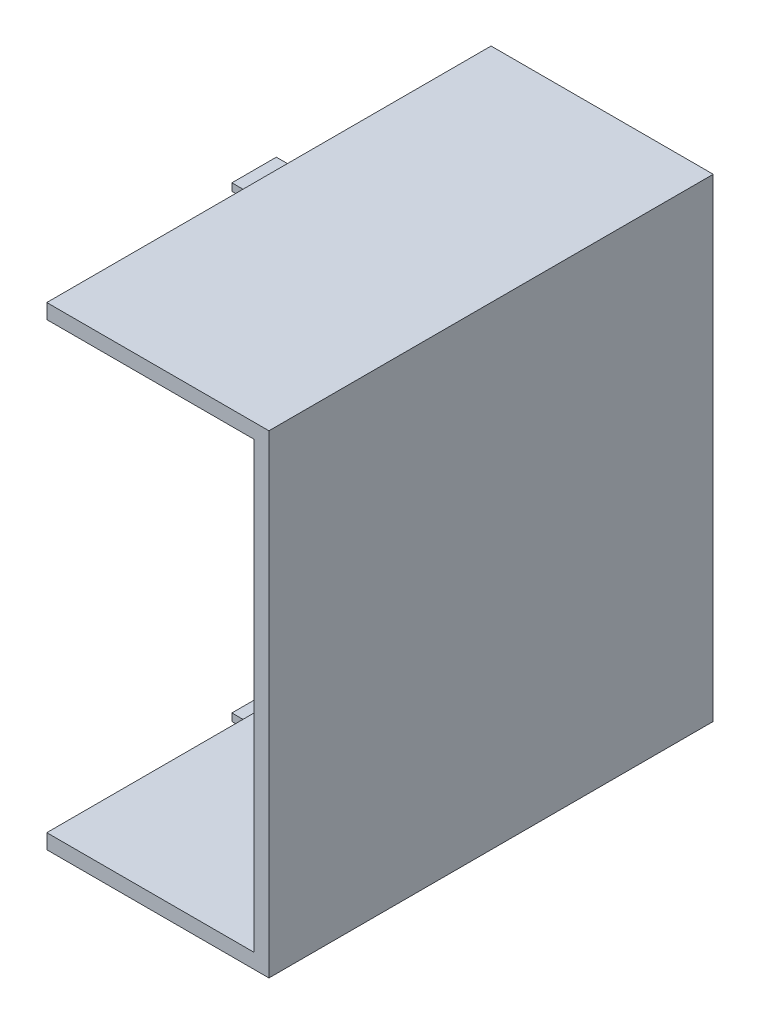
ISO-10303-21;
HEADER;
FILE_DESCRIPTION(('STEP AP214'),'2;1');
FILE_NAME('part.step','',(''),(''),'','','');
FILE_SCHEMA(('AUTOMOTIVE_DESIGN { 1 0 10303 214 1 1 1 1 }'));
ENDSEC;
DATA;
#1=APPLICATION_CONTEXT('core data for automotive mechanical design processes');
#2=APPLICATION_PROTOCOL_DEFINITION('international standard','automotive_design',2000,#1);
#3=PRODUCT_CONTEXT('',#1,'mechanical');
#4=PRODUCT('Part','Part','',(#3));
#5=PRODUCT_RELATED_PRODUCT_CATEGORY('part','',(#4));
#6=PRODUCT_DEFINITION_FORMATION('','',#4);
#7=PRODUCT_DEFINITION_CONTEXT('part definition',#1,'design');
#8=PRODUCT_DEFINITION('design','',#6,#7);
#9=PRODUCT_DEFINITION_SHAPE('','',#8);
#10=(LENGTH_UNIT() NAMED_UNIT(*) SI_UNIT(.MILLI.,.METRE.));
#11=(NAMED_UNIT(*) PLANE_ANGLE_UNIT() SI_UNIT($,.RADIAN.));
#12=(NAMED_UNIT(*) SI_UNIT($,.STERADIAN.) SOLID_ANGLE_UNIT());
#13=UNCERTAINTY_MEASURE_WITH_UNIT(LENGTH_MEASURE(1.E-05),#10,'distance_accuracy_value','');
#14=(GEOMETRIC_REPRESENTATION_CONTEXT(3) GLOBAL_UNCERTAINTY_ASSIGNED_CONTEXT((#13)) GLOBAL_UNIT_ASSIGNED_CONTEXT((#10,
#11,#12)) REPRESENTATION_CONTEXT('',''));
#15=CARTESIAN_POINT('',(0.,0.,0.));
#16=DIRECTION('',(0.,0.,1.));
#17=DIRECTION('',(1.,0.,0.));
#18=AXIS2_PLACEMENT_3D('',#15,#16,#17);
#19=CARTESIAN_POINT('',(0.,1.,15.));
#20=DIRECTION('',(1.,0.,0.));
#21=DIRECTION('',(0.,0.,-1.));
#22=AXIS2_PLACEMENT_3D('',#19,#20,#21);
#23=PLANE('',#22);
#24=DIRECTION('',(0.,-1.,0.));
#25=VECTOR('',#24,1.);
#26=CARTESIAN_POINT('',(0.,1.,-15.));
#27=LINE('',#26,#25);
#28=CARTESIAN_POINT('',(0.,1.,-15.));
#29=VERTEX_POINT('',#28);
#30=CARTESIAN_POINT('',(0.,0.,-15.));
#31=VERTEX_POINT('',#30);
#32=EDGE_CURVE('E231',#29,#31,#27,.T.);
#33=ORIENTED_EDGE('',*,*,#32,.T.);
#34=DIRECTION('',(0.,0.,-1.));
#35=VECTOR('',#34,1.);
#36=CARTESIAN_POINT('',(0.,0.,15.));
#37=LINE('',#36,#35);
#38=CARTESIAN_POINT('',(0.,0.,15.));
#39=VERTEX_POINT('',#38);
#40=EDGE_CURVE('E251',#39,#31,#37,.T.);
#41=ORIENTED_EDGE('',*,*,#40,.F.);
#42=DIRECTION('',(0.,-1.,0.));
#43=VECTOR('',#42,1.);
#44=CARTESIAN_POINT('',(0.,1.,15.));
#45=LINE('',#44,#43);
#46=CARTESIAN_POINT('',(0.,1.,15.));
#47=VERTEX_POINT('',#46);
#48=EDGE_CURVE('E214',#47,#39,#45,.T.);
#49=ORIENTED_EDGE('',*,*,#48,.F.);
#50=DIRECTION('',(0.,0.,-1.));
#51=VECTOR('',#50,1.);
#52=CARTESIAN_POINT('',(0.,1.,15.));
#53=LINE('',#52,#51);
#54=EDGE_CURVE('E254',#47,#29,#53,.T.);
#55=ORIENTED_EDGE('',*,*,#54,.T.);
#56=EDGE_LOOP('',(#33,#41,#49,#55));
#57=FACE_BOUND('',#56,.T.);
#58=DIRECTION('',(0.,-1.,0.));
#59=VECTOR('',#58,1.);
#60=CARTESIAN_POINT('',(0.,0.75,-1.5));
#61=LINE('',#60,#59);
#62=CARTESIAN_POINT('',(0.,0.75,-1.5));
#63=VERTEX_POINT('',#62);
#64=CARTESIAN_POINT('',(0.,0.25,-1.5));
#65=VERTEX_POINT('',#64);
#66=EDGE_CURVE('E166',#63,#65,#61,.T.);
#67=ORIENTED_EDGE('',*,*,#66,.F.);
#68=DIRECTION('',(0.,0.,-1.));
#69=VECTOR('',#68,1.);
#70=CARTESIAN_POINT('',(0.,0.75,-1.5));
#71=LINE('',#70,#69);
#72=CARTESIAN_POINT('',(0.,0.75,1.5));
#73=VERTEX_POINT('',#72);
#74=EDGE_CURVE('E163',#73,#63,#71,.T.);
#75=ORIENTED_EDGE('',*,*,#74,.F.);
#76=DIRECTION('',(0.,1.,0.));
#77=VECTOR('',#76,1.);
#78=CARTESIAN_POINT('',(0.,0.75,1.5));
#79=LINE('',#78,#77);
#80=CARTESIAN_POINT('',(0.,0.25,1.5));
#81=VERTEX_POINT('',#80);
#82=EDGE_CURVE('E53',#81,#73,#79,.T.);
#83=ORIENTED_EDGE('',*,*,#82,.F.);
#84=DIRECTION('',(0.,0.,1.));
#85=VECTOR('',#84,1.);
#86=CARTESIAN_POINT('',(0.,0.25,-1.5));
#87=LINE('',#86,#85);
#88=EDGE_CURVE('E48',#65,#81,#87,.T.);
#89=ORIENTED_EDGE('',*,*,#88,.F.);
#90=EDGE_LOOP('',(#67,#75,#83,#89));
#91=FACE_BOUND('',#90,.T.);
#92=ADVANCED_FACE('F33',(#57,#91),#23,.F.);
#93=CARTESIAN_POINT('',(0.,32.,15.));
#94=DIRECTION('',(1.,0.,0.));
#95=DIRECTION('',(0.,1.,0.));
#96=AXIS2_PLACEMENT_3D('',#93,#94,#95);
#97=PLANE('',#96);
#98=DIRECTION('',(0.,-1.,0.));
#99=VECTOR('',#98,1.);
#100=CARTESIAN_POINT('',(0.,32.,-15.));
#101=LINE('',#100,#99);
#102=CARTESIAN_POINT('',(0.,32.,-15.));
#103=VERTEX_POINT('',#102);
#104=CARTESIAN_POINT('',(0.,31.,-15.));
#105=VERTEX_POINT('',#104);
#106=EDGE_CURVE('E210',#103,#105,#101,.T.);
#107=ORIENTED_EDGE('',*,*,#106,.T.);
#108=DIRECTION('',(0.,0.,-1.));
#109=VECTOR('',#108,1.);
#110=CARTESIAN_POINT('',(0.,31.,15.));
#111=LINE('',#110,#109);
#112=CARTESIAN_POINT('',(0.,31.,15.));
#113=VERTEX_POINT('',#112);
#114=EDGE_CURVE('E224',#113,#105,#111,.T.);
#115=ORIENTED_EDGE('',*,*,#114,.F.);
#116=DIRECTION('',(0.,-1.,0.));
#117=VECTOR('',#116,1.);
#118=CARTESIAN_POINT('',(0.,32.,15.));
#119=LINE('',#118,#117);
#120=CARTESIAN_POINT('',(0.,32.,15.));
#121=VERTEX_POINT('',#120);
#122=EDGE_CURVE('E222',#121,#113,#119,.T.);
#123=ORIENTED_EDGE('',*,*,#122,.F.);
#124=DIRECTION('',(0.,0.,-1.));
#125=VECTOR('',#124,1.);
#126=CARTESIAN_POINT('',(0.,32.,15.));
#127=LINE('',#126,#125);
#128=EDGE_CURVE('E242',#121,#103,#127,.T.);
#129=ORIENTED_EDGE('',*,*,#128,.T.);
#130=EDGE_LOOP('',(#107,#115,#123,#129));
#131=FACE_BOUND('',#130,.T.);
#132=DIRECTION('',(0.,-1.,0.));
#133=VECTOR('',#132,1.);
#134=CARTESIAN_POINT('',(0.,31.75,-1.5));
#135=LINE('',#134,#133);
#136=CARTESIAN_POINT('',(0.,31.75,-1.5));
#137=VERTEX_POINT('',#136);
#138=CARTESIAN_POINT('',(0.,31.25,-1.5));
#139=VERTEX_POINT('',#138);
#140=EDGE_CURVE('E167',#137,#139,#135,.T.);
#141=ORIENTED_EDGE('',*,*,#140,.F.);
#142=DIRECTION('',(0.,0.,-1.));
#143=VECTOR('',#142,1.);
#144=CARTESIAN_POINT('',(0.,31.75,-1.5));
#145=LINE('',#144,#143);
#146=CARTESIAN_POINT('',(0.,31.75,1.5));
#147=VERTEX_POINT('',#146);
#148=EDGE_CURVE('E180',#147,#137,#145,.T.);
#149=ORIENTED_EDGE('',*,*,#148,.F.);
#150=DIRECTION('',(0.,1.,0.));
#151=VECTOR('',#150,1.);
#152=CARTESIAN_POINT('',(0.,31.75,1.5));
#153=LINE('',#152,#151);
#154=CARTESIAN_POINT('',(0.,31.25,1.5));
#155=VERTEX_POINT('',#154);
#156=EDGE_CURVE('E189',#155,#147,#153,.T.);
#157=ORIENTED_EDGE('',*,*,#156,.F.);
#158=DIRECTION('',(0.,0.,1.));
#159=VECTOR('',#158,1.);
#160=CARTESIAN_POINT('',(0.,31.25,-1.5));
#161=LINE('',#160,#159);
#162=EDGE_CURVE('E170',#139,#155,#161,.T.);
#163=ORIENTED_EDGE('',*,*,#162,.F.);
#164=EDGE_LOOP('',(#141,#149,#157,#163));
#165=FACE_BOUND('',#164,.T.);
#166=ADVANCED_FACE('F289',(#131,#165),#97,.F.);
#167=CARTESIAN_POINT('',(0.,31.,15.));
#168=DIRECTION('',(0.,1.,0.));
#169=DIRECTION('',(0.,0.,1.));
#170=AXIS2_PLACEMENT_3D('',#167,#168,#169);
#171=PLANE('',#170);
#172=DIRECTION('',(1.,0.,0.));
#173=VECTOR('',#172,1.);
#174=CARTESIAN_POINT('',(0.,31.,-15.));
#175=LINE('',#174,#173);
#176=CARTESIAN_POINT('',(14.,31.,-15.));
#177=VERTEX_POINT('',#176);
#178=EDGE_CURVE('E205',#105,#177,#175,.T.);
#179=ORIENTED_EDGE('',*,*,#178,.T.);
#180=DIRECTION('',(0.,0.,-1.));
#181=VECTOR('',#180,1.);
#182=CARTESIAN_POINT('',(14.,31.,15.));
#183=LINE('',#182,#181);
#184=CARTESIAN_POINT('',(14.,31.,15.));
#185=VERTEX_POINT('',#184);
#186=EDGE_CURVE('E11',#185,#177,#183,.T.);
#187=ORIENTED_EDGE('',*,*,#186,.F.);
#188=DIRECTION('',(1.,0.,0.));
#189=VECTOR('',#188,1.);
#190=CARTESIAN_POINT('',(0.,31.,15.));
#191=LINE('',#190,#189);
#192=EDGE_CURVE('E206',#113,#185,#191,.T.);
#193=ORIENTED_EDGE('',*,*,#192,.F.);
#194=ORIENTED_EDGE('',*,*,#114,.T.);
#195=EDGE_LOOP('',(#179,#187,#193,#194));
#196=FACE_BOUND('',#195,.T.);
#197=ADVANCED_FACE('F35',(#196),#171,.F.);
#198=CARTESIAN_POINT('',(14.,31.,15.));
#199=DIRECTION('',(1.,0.,0.));
#200=DIRECTION('',(0.,1.,0.));
#201=AXIS2_PLACEMENT_3D('',#198,#199,#200);
#202=PLANE('',#201);
#203=DIRECTION('',(0.,-1.,0.));
#204=VECTOR('',#203,1.);
#205=CARTESIAN_POINT('',(14.,31.,-15.));
#206=LINE('',#205,#204);
#207=CARTESIAN_POINT('',(14.,1.,-15.));
#208=VERTEX_POINT('',#207);
#209=EDGE_CURVE('E227',#177,#208,#206,.T.);
#210=ORIENTED_EDGE('',*,*,#209,.T.);
#211=DIRECTION('',(0.,0.,-1.));
#212=VECTOR('',#211,1.);
#213=CARTESIAN_POINT('',(14.,1.,15.));
#214=LINE('',#213,#212);
#215=CARTESIAN_POINT('',(14.,1.,15.));
#216=VERTEX_POINT('',#215);
#217=EDGE_CURVE('E41',#216,#208,#214,.T.);
#218=ORIENTED_EDGE('',*,*,#217,.F.);
#219=DIRECTION('',(0.,-1.,0.));
#220=VECTOR('',#219,1.);
#221=CARTESIAN_POINT('',(14.,31.,15.));
#222=LINE('',#221,#220);
#223=EDGE_CURVE('E209',#185,#216,#222,.T.);
#224=ORIENTED_EDGE('',*,*,#223,.F.);
#225=ORIENTED_EDGE('',*,*,#186,.T.);
#226=EDGE_LOOP('',(#210,#218,#224,#225));
#227=FACE_BOUND('',#226,.T.);
#228=ADVANCED_FACE('F283',(#227),#202,.F.);
#229=CARTESIAN_POINT('',(14.,1.,15.));
#230=DIRECTION('',(0.,-1.,0.));
#231=DIRECTION('',(1.,0.,0.));
#232=AXIS2_PLACEMENT_3D('',#229,#230,#231);
#233=PLANE('',#232);
#234=DIRECTION('',(-1.,0.,0.));
#235=VECTOR('',#234,1.);
#236=CARTESIAN_POINT('',(14.,1.,-15.));
#237=LINE('',#236,#235);
#238=EDGE_CURVE('E229',#208,#29,#237,.T.);
#239=ORIENTED_EDGE('',*,*,#238,.T.);
#240=ORIENTED_EDGE('',*,*,#54,.F.);
#241=DIRECTION('',(-1.,0.,0.));
#242=VECTOR('',#241,1.);
#243=CARTESIAN_POINT('',(14.,1.,15.));
#244=LINE('',#243,#242);
#245=EDGE_CURVE('E212',#216,#47,#244,.T.);
#246=ORIENTED_EDGE('',*,*,#245,.F.);
#247=ORIENTED_EDGE('',*,*,#217,.T.);
#248=EDGE_LOOP('',(#239,#240,#246,#247));
#249=FACE_BOUND('',#248,.T.);
#250=ADVANCED_FACE('F261',(#249),#233,.F.);
#251=CARTESIAN_POINT('',(0.,0.,15.));
#252=DIRECTION('',(0.,1.,0.));
#253=DIRECTION('',(0.,0.,1.));
#254=AXIS2_PLACEMENT_3D('',#251,#252,#253);
#255=PLANE('',#254);
#256=DIRECTION('',(1.,0.,0.));
#257=VECTOR('',#256,1.);
#258=CARTESIAN_POINT('',(0.,0.,-15.));
#259=LINE('',#258,#257);
#260=CARTESIAN_POINT('',(15.,0.,-15.));
#261=VERTEX_POINT('',#260);
#262=EDGE_CURVE('E233',#31,#261,#259,.T.);
#263=ORIENTED_EDGE('',*,*,#262,.T.);
#264=DIRECTION('',(0.,0.,-1.));
#265=VECTOR('',#264,1.);
#266=CARTESIAN_POINT('',(15.,0.,15.));
#267=LINE('',#266,#265);
#268=CARTESIAN_POINT('',(15.,0.,15.));
#269=VERTEX_POINT('',#268);
#270=EDGE_CURVE('E248',#269,#261,#267,.T.);
#271=ORIENTED_EDGE('',*,*,#270,.F.);
#272=DIRECTION('',(1.,0.,0.));
#273=VECTOR('',#272,1.);
#274=CARTESIAN_POINT('',(0.,0.,15.));
#275=LINE('',#274,#273);
#276=EDGE_CURVE('E216',#39,#269,#275,.T.);
#277=ORIENTED_EDGE('',*,*,#276,.F.);
#278=ORIENTED_EDGE('',*,*,#40,.T.);
#279=EDGE_LOOP('',(#263,#271,#277,#278));
#280=FACE_BOUND('',#279,.T.);
#281=ADVANCED_FACE('F275',(#280),#255,.F.);
#282=CARTESIAN_POINT('',(15.,0.,15.));
#283=DIRECTION('',(-1.,0.,0.));
#284=DIRECTION('',(0.,0.,1.));
#285=AXIS2_PLACEMENT_3D('',#282,#283,#284);
#286=PLANE('',#285);
#287=DIRECTION('',(0.,1.,0.));
#288=VECTOR('',#287,1.);
#289=CARTESIAN_POINT('',(15.,0.,-15.));
#290=LINE('',#289,#288);
#291=CARTESIAN_POINT('',(15.,32.,-15.));
#292=VERTEX_POINT('',#291);
#293=EDGE_CURVE('E235',#261,#292,#290,.T.);
#294=ORIENTED_EDGE('',*,*,#293,.T.);
#295=DIRECTION('',(0.,0.,-1.));
#296=VECTOR('',#295,1.);
#297=CARTESIAN_POINT('',(15.,32.,15.));
#298=LINE('',#297,#296);
#299=CARTESIAN_POINT('',(15.,32.,15.));
#300=VERTEX_POINT('',#299);
#301=EDGE_CURVE('E245',#300,#292,#298,.T.);
#302=ORIENTED_EDGE('',*,*,#301,.F.);
#303=DIRECTION('',(0.,1.,0.));
#304=VECTOR('',#303,1.);
#305=CARTESIAN_POINT('',(15.,0.,15.));
#306=LINE('',#305,#304);
#307=EDGE_CURVE('E218',#269,#300,#306,.T.);
#308=ORIENTED_EDGE('',*,*,#307,.F.);
#309=ORIENTED_EDGE('',*,*,#270,.T.);
#310=EDGE_LOOP('',(#294,#302,#308,#309));
#311=FACE_BOUND('',#310,.T.);
#312=ADVANCED_FACE('F297',(#311),#286,.F.);
#313=CARTESIAN_POINT('',(15.,32.,15.));
#314=DIRECTION('',(0.,-1.,0.));
#315=DIRECTION('',(0.,0.,-1.));
#316=AXIS2_PLACEMENT_3D('',#313,#314,#315);
#317=PLANE('',#316);
#318=DIRECTION('',(-1.,0.,0.));
#319=VECTOR('',#318,1.);
#320=CARTESIAN_POINT('',(15.,32.,-15.));
#321=LINE('',#320,#319);
#322=EDGE_CURVE('E237',#292,#103,#321,.T.);
#323=ORIENTED_EDGE('',*,*,#322,.T.);
#324=ORIENTED_EDGE('',*,*,#128,.F.);
#325=DIRECTION('',(-1.,0.,0.));
#326=VECTOR('',#325,1.);
#327=CARTESIAN_POINT('',(15.,32.,15.));
#328=LINE('',#327,#326);
#329=EDGE_CURVE('E220',#300,#121,#328,.T.);
#330=ORIENTED_EDGE('',*,*,#329,.F.);
#331=ORIENTED_EDGE('',*,*,#301,.T.);
#332=EDGE_LOOP('',(#323,#324,#330,#331));
#333=FACE_BOUND('',#332,.T.);
#334=ADVANCED_FACE('F295',(#333),#317,.F.);
#335=CARTESIAN_POINT('',(0.,0.,15.));
#336=DIRECTION('',(0.,0.,-1.));
#337=DIRECTION('',(-1.,0.,0.));
#338=AXIS2_PLACEMENT_3D('',#335,#336,#337);
#339=PLANE('',#338);
#340=ORIENTED_EDGE('',*,*,#192,.T.);
#341=ORIENTED_EDGE('',*,*,#223,.T.);
#342=ORIENTED_EDGE('',*,*,#245,.T.);
#343=ORIENTED_EDGE('',*,*,#48,.T.);
#344=ORIENTED_EDGE('',*,*,#276,.T.);
#345=ORIENTED_EDGE('',*,*,#307,.T.);
#346=ORIENTED_EDGE('',*,*,#329,.T.);
#347=ORIENTED_EDGE('',*,*,#122,.T.);
#348=EDGE_LOOP('',(#340,#341,#342,#343,#344,#345,#346,#347));
#349=FACE_BOUND('',#348,.T.);
#350=ADVANCED_FACE('F279',(#349),#339,.F.);
#351=CARTESIAN_POINT('',(0.,0.,-15.));
#352=DIRECTION('',(0.,0.,-1.));
#353=DIRECTION('',(-1.,0.,0.));
#354=AXIS2_PLACEMENT_3D('',#351,#352,#353);
#355=PLANE('',#354);
#356=ORIENTED_EDGE('',*,*,#178,.F.);
#357=ORIENTED_EDGE('',*,*,#106,.F.);
#358=ORIENTED_EDGE('',*,*,#322,.F.);
#359=ORIENTED_EDGE('',*,*,#293,.F.);
#360=ORIENTED_EDGE('',*,*,#262,.F.);
#361=ORIENTED_EDGE('',*,*,#32,.F.);
#362=ORIENTED_EDGE('',*,*,#238,.F.);
#363=ORIENTED_EDGE('',*,*,#209,.F.);
#364=EDGE_LOOP('',(#356,#357,#358,#359,#360,#361,#362,#363));
#365=FACE_BOUND('',#364,.T.);
#366=ADVANCED_FACE('F267',(#365),#355,.T.);
#367=CARTESIAN_POINT('',(-1.00000000000003,31.75,-1.5));
#368=DIRECTION('',(0.,0.,1.));
#369=DIRECTION('',(1.,0.,0.));
#370=AXIS2_PLACEMENT_3D('',#367,#368,#369);
#371=PLANE('',#370);
#372=ORIENTED_EDGE('',*,*,#140,.T.);
#373=DIRECTION('',(1.,0.,0.));
#374=VECTOR('',#373,1.);
#375=CARTESIAN_POINT('',(-1.00000000000003,31.25,-1.5));
#376=LINE('',#375,#374);
#377=CARTESIAN_POINT('',(-1.00000000000003,31.25,-1.5));
#378=VERTEX_POINT('',#377);
#379=EDGE_CURVE('E202',#378,#139,#376,.T.);
#380=ORIENTED_EDGE('',*,*,#379,.F.);
#381=DIRECTION('',(0.,-1.,0.));
#382=VECTOR('',#381,1.);
#383=CARTESIAN_POINT('',(-1.00000000000003,31.75,-1.5));
#384=LINE('',#383,#382);
#385=CARTESIAN_POINT('',(-1.00000000000003,31.75,-1.5));
#386=VERTEX_POINT('',#385);
#387=EDGE_CURVE('E176',#386,#378,#384,.T.);
#388=ORIENTED_EDGE('',*,*,#387,.F.);
#389=DIRECTION('',(1.,0.,0.));
#390=VECTOR('',#389,1.);
#391=CARTESIAN_POINT('',(-1.00000000000003,31.75,-1.5));
#392=LINE('',#391,#390);
#393=EDGE_CURVE('E185',#386,#137,#392,.T.);
#394=ORIENTED_EDGE('',*,*,#393,.T.);
#395=EDGE_LOOP('',(#372,#380,#388,#394));
#396=FACE_BOUND('',#395,.T.);
#397=ADVANCED_FACE('F335',(#396),#371,.F.);
#398=CARTESIAN_POINT('',(-1.00000000000003,31.25,-1.5));
#399=DIRECTION('',(0.,1.,0.));
#400=DIRECTION('',(-1.,0.,0.));
#401=AXIS2_PLACEMENT_3D('',#398,#399,#400);
#402=PLANE('',#401);
#403=ORIENTED_EDGE('',*,*,#162,.T.);
#404=DIRECTION('',(1.,0.,0.));
#405=VECTOR('',#404,1.);
#406=CARTESIAN_POINT('',(-1.00000000000003,31.25,1.5));
#407=LINE('',#406,#405);
#408=CARTESIAN_POINT('',(-1.00000000000003,31.25,1.5));
#409=VERTEX_POINT('',#408);
#410=EDGE_CURVE('E199',#409,#155,#407,.T.);
#411=ORIENTED_EDGE('',*,*,#410,.F.);
#412=DIRECTION('',(0.,0.,1.));
#413=VECTOR('',#412,1.);
#414=CARTESIAN_POINT('',(-1.00000000000003,31.25,-1.5));
#415=LINE('',#414,#413);
#416=EDGE_CURVE('E179',#378,#409,#415,.T.);
#417=ORIENTED_EDGE('',*,*,#416,.F.);
#418=ORIENTED_EDGE('',*,*,#379,.T.);
#419=EDGE_LOOP('',(#403,#411,#417,#418));
#420=FACE_BOUND('',#419,.T.);
#421=ADVANCED_FACE('F339',(#420),#402,.F.);
#422=CARTESIAN_POINT('',(-1.00000000000003,31.75,1.5));
#423=DIRECTION('',(0.,0.,-1.));
#424=DIRECTION('',(-1.,0.,0.));
#425=AXIS2_PLACEMENT_3D('',#422,#423,#424);
#426=PLANE('',#425);
#427=ORIENTED_EDGE('',*,*,#156,.T.);
#428=DIRECTION('',(1.,0.,0.));
#429=VECTOR('',#428,1.);
#430=CARTESIAN_POINT('',(-1.00000000000003,31.75,1.5));
#431=LINE('',#430,#429);
#432=CARTESIAN_POINT('',(-1.00000000000003,31.75,1.5));
#433=VERTEX_POINT('',#432);
#434=EDGE_CURVE('E196',#433,#147,#431,.T.);
#435=ORIENTED_EDGE('',*,*,#434,.F.);
#436=DIRECTION('',(0.,1.,0.));
#437=VECTOR('',#436,1.);
#438=CARTESIAN_POINT('',(-1.00000000000003,31.75,1.5));
#439=LINE('',#438,#437);
#440=EDGE_CURVE('E182',#409,#433,#439,.T.);
#441=ORIENTED_EDGE('',*,*,#440,.F.);
#442=ORIENTED_EDGE('',*,*,#410,.T.);
#443=EDGE_LOOP('',(#427,#435,#441,#442));
#444=FACE_BOUND('',#443,.T.);
#445=ADVANCED_FACE('F349',(#444),#426,.F.);
#446=CARTESIAN_POINT('',(-1.00000000000003,31.75,-1.5));
#447=DIRECTION('',(0.,-1.,0.));
#448=DIRECTION('',(1.,0.,0.));
#449=AXIS2_PLACEMENT_3D('',#446,#447,#448);
#450=PLANE('',#449);
#451=ORIENTED_EDGE('',*,*,#148,.T.);
#452=ORIENTED_EDGE('',*,*,#393,.F.);
#453=DIRECTION('',(0.,0.,-1.));
#454=VECTOR('',#453,1.);
#455=CARTESIAN_POINT('',(-1.00000000000003,31.75,-1.5));
#456=LINE('',#455,#454);
#457=EDGE_CURVE('E184',#433,#386,#456,.T.);
#458=ORIENTED_EDGE('',*,*,#457,.F.);
#459=ORIENTED_EDGE('',*,*,#434,.T.);
#460=EDGE_LOOP('',(#451,#452,#458,#459));
#461=FACE_BOUND('',#460,.T.);
#462=ADVANCED_FACE('F359',(#461),#450,.F.);
#463=CARTESIAN_POINT('',(-1.,0.,0.));
#464=DIRECTION('',(-1.,0.,0.));
#465=DIRECTION('',(0.,-1.,0.));
#466=AXIS2_PLACEMENT_3D('',#463,#464,#465);
#467=PLANE('',#466);
#468=ORIENTED_EDGE('',*,*,#387,.T.);
#469=ORIENTED_EDGE('',*,*,#416,.T.);
#470=ORIENTED_EDGE('',*,*,#440,.T.);
#471=ORIENTED_EDGE('',*,*,#457,.T.);
#472=EDGE_LOOP('',(#468,#469,#470,#471));
#473=FACE_BOUND('',#472,.T.);
#474=ADVANCED_FACE('F369',(#473),#467,.T.);
#475=CARTESIAN_POINT('',(-1.,0.75,-1.5));
#476=DIRECTION('',(0.,0.,1.));
#477=DIRECTION('',(1.,0.,0.));
#478=AXIS2_PLACEMENT_3D('',#475,#476,#477);
#479=PLANE('',#478);
#480=ORIENTED_EDGE('',*,*,#66,.T.);
#481=DIRECTION('',(1.,0.,0.));
#482=VECTOR('',#481,1.);
#483=CARTESIAN_POINT('',(-1.,0.25,-1.5));
#484=LINE('',#483,#482);
#485=CARTESIAN_POINT('',(-1.,0.25,-1.5));
#486=VERTEX_POINT('',#485);
#487=EDGE_CURVE('E147',#486,#65,#484,.T.);
#488=ORIENTED_EDGE('',*,*,#487,.F.);
#489=DIRECTION('',(0.,-1.,0.));
#490=VECTOR('',#489,1.);
#491=CARTESIAN_POINT('',(-1.,0.75,-1.5));
#492=LINE('',#491,#490);
#493=CARTESIAN_POINT('',(-1.,0.75,-1.5));
#494=VERTEX_POINT('',#493);
#495=EDGE_CURVE('E154',#494,#486,#492,.T.);
#496=ORIENTED_EDGE('',*,*,#495,.F.);
#497=DIRECTION('',(1.,0.,0.));
#498=VECTOR('',#497,1.);
#499=CARTESIAN_POINT('',(-1.,0.75,-1.5));
#500=LINE('',#499,#498);
#501=EDGE_CURVE('E472',#494,#63,#500,.T.);
#502=ORIENTED_EDGE('',*,*,#501,.T.);
#503=EDGE_LOOP('',(#480,#488,#496,#502));
#504=FACE_BOUND('',#503,.T.);
#505=ADVANCED_FACE('F165',(#504),#479,.F.);
#506=CARTESIAN_POINT('',(-1.,0.25,-1.5));
#507=DIRECTION('',(0.,1.,0.));
#508=DIRECTION('',(0.,0.,1.));
#509=AXIS2_PLACEMENT_3D('',#506,#507,#508);
#510=PLANE('',#509);
#511=ORIENTED_EDGE('',*,*,#88,.T.);
#512=DIRECTION('',(1.,0.,0.));
#513=VECTOR('',#512,1.);
#514=CARTESIAN_POINT('',(-1.,0.25,1.5));
#515=LINE('',#514,#513);
#516=CARTESIAN_POINT('',(-1.,0.25,1.5));
#517=VERTEX_POINT('',#516);
#518=EDGE_CURVE('E150',#517,#81,#515,.T.);
#519=ORIENTED_EDGE('',*,*,#518,.F.);
#520=DIRECTION('',(0.,0.,1.));
#521=VECTOR('',#520,1.);
#522=CARTESIAN_POINT('',(-1.,0.25,-1.5));
#523=LINE('',#522,#521);
#524=EDGE_CURVE('E143',#486,#517,#523,.T.);
#525=ORIENTED_EDGE('',*,*,#524,.F.);
#526=ORIENTED_EDGE('',*,*,#487,.T.);
#527=EDGE_LOOP('',(#511,#519,#525,#526));
#528=FACE_BOUND('',#527,.T.);
#529=ADVANCED_FACE('F145',(#528),#510,.F.);
#530=CARTESIAN_POINT('',(-1.,0.75,1.5));
#531=DIRECTION('',(0.,0.,-1.));
#532=DIRECTION('',(-1.,0.,0.));
#533=AXIS2_PLACEMENT_3D('',#530,#531,#532);
#534=PLANE('',#533);
#535=ORIENTED_EDGE('',*,*,#82,.T.);
#536=DIRECTION('',(1.,0.,0.));
#537=VECTOR('',#536,1.);
#538=CARTESIAN_POINT('',(-1.,0.75,1.5));
#539=LINE('',#538,#537);
#540=CARTESIAN_POINT('',(-1.,0.75,1.5));
#541=VERTEX_POINT('',#540);
#542=EDGE_CURVE('E172',#541,#73,#539,.T.);
#543=ORIENTED_EDGE('',*,*,#542,.F.);
#544=DIRECTION('',(0.,1.,0.));
#545=VECTOR('',#544,1.);
#546=CARTESIAN_POINT('',(-1.,0.75,1.5));
#547=LINE('',#546,#545);
#548=EDGE_CURVE('E153',#517,#541,#547,.T.);
#549=ORIENTED_EDGE('',*,*,#548,.F.);
#550=ORIENTED_EDGE('',*,*,#518,.T.);
#551=EDGE_LOOP('',(#535,#543,#549,#550));
#552=FACE_BOUND('',#551,.T.);
#553=ADVANCED_FACE('F400',(#552),#534,.F.);
#554=CARTESIAN_POINT('',(-1.,0.75,-1.5));
#555=DIRECTION('',(0.,-1.,0.));
#556=DIRECTION('',(0.,0.,-1.));
#557=AXIS2_PLACEMENT_3D('',#554,#555,#556);
#558=PLANE('',#557);
#559=ORIENTED_EDGE('',*,*,#74,.T.);
#560=ORIENTED_EDGE('',*,*,#501,.F.);
#561=DIRECTION('',(0.,0.,-1.));
#562=VECTOR('',#561,1.);
#563=CARTESIAN_POINT('',(-1.,0.75,-1.5));
#564=LINE('',#563,#562);
#565=EDGE_CURVE('E159',#541,#494,#564,.T.);
#566=ORIENTED_EDGE('',*,*,#565,.F.);
#567=ORIENTED_EDGE('',*,*,#542,.T.);
#568=EDGE_LOOP('',(#559,#560,#566,#567));
#569=FACE_BOUND('',#568,.T.);
#570=ADVANCED_FACE('F409',(#569),#558,.F.);
#571=CARTESIAN_POINT('',(-1.,0.,0.));
#572=DIRECTION('',(-1.,0.,0.));
#573=DIRECTION('',(0.,0.,1.));
#574=AXIS2_PLACEMENT_3D('',#571,#572,#573);
#575=PLANE('',#574);
#576=ORIENTED_EDGE('',*,*,#495,.T.);
#577=ORIENTED_EDGE('',*,*,#524,.T.);
#578=ORIENTED_EDGE('',*,*,#548,.T.);
#579=ORIENTED_EDGE('',*,*,#565,.T.);
#580=EDGE_LOOP('',(#576,#577,#578,#579));
#581=FACE_BOUND('',#580,.T.);
#582=ADVANCED_FACE('F157',(#581),#575,.T.);
#583=CLOSED_SHELL('',(#92,#166,#197,#228,#250,#281,#312,#334,#350,#366,#397,#421,#445,#462,#474,
#505,#529,#553,#570,#582));
#584=MANIFOLD_SOLID_BREP('B2',#583);
#585=ADVANCED_BREP_SHAPE_REPRESENTATION('',(#18,#584),#14);
#586=SHAPE_DEFINITION_REPRESENTATION(#9,#585);
ENDSEC;
END-ISO-10303-21;
